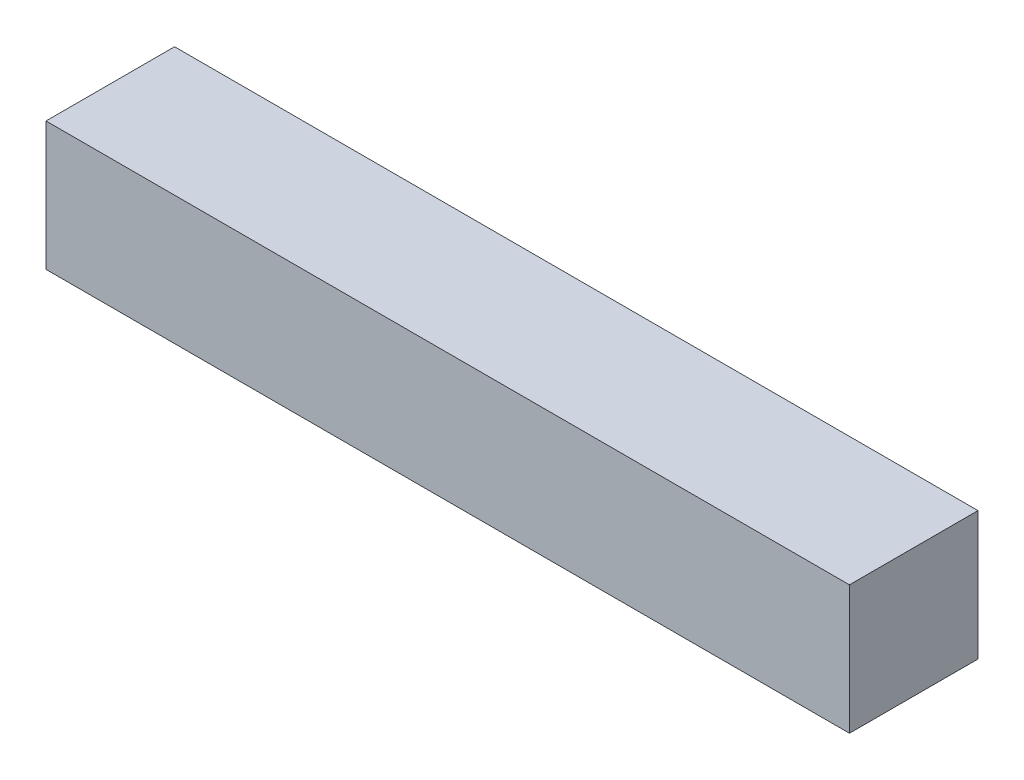
ISO-10303-21;
HEADER;
FILE_DESCRIPTION(('STEP AP214'),'2;1');
FILE_NAME('part.step','',(''),(''),'','','');
FILE_SCHEMA(('AUTOMOTIVE_DESIGN { 1 0 10303 214 1 1 1 1 }'));
ENDSEC;
DATA;
#1=APPLICATION_CONTEXT('core data for automotive mechanical design processes');
#2=APPLICATION_PROTOCOL_DEFINITION('international standard','automotive_design',2000,#1);
#3=PRODUCT_CONTEXT('',#1,'mechanical');
#4=PRODUCT('Part','Part','',(#3));
#5=PRODUCT_RELATED_PRODUCT_CATEGORY('part','',(#4));
#6=PRODUCT_DEFINITION_FORMATION('','',#4);
#7=PRODUCT_DEFINITION_CONTEXT('part definition',#1,'design');
#8=PRODUCT_DEFINITION('design','',#6,#7);
#9=PRODUCT_DEFINITION_SHAPE('','',#8);
#10=(LENGTH_UNIT() NAMED_UNIT(*) SI_UNIT(.MILLI.,.METRE.));
#11=(NAMED_UNIT(*) PLANE_ANGLE_UNIT() SI_UNIT($,.RADIAN.));
#12=(NAMED_UNIT(*) SI_UNIT($,.STERADIAN.) SOLID_ANGLE_UNIT());
#13=UNCERTAINTY_MEASURE_WITH_UNIT(LENGTH_MEASURE(1.E-05),#10,'distance_accuracy_value','');
#14=(GEOMETRIC_REPRESENTATION_CONTEXT(3) GLOBAL_UNCERTAINTY_ASSIGNED_CONTEXT((#13)) GLOBAL_UNIT_ASSIGNED_CONTEXT((#10,
#11,#12)) REPRESENTATION_CONTEXT('',''));
#15=CARTESIAN_POINT('',(0.,0.,0.));
#16=DIRECTION('',(0.,0.,1.));
#17=DIRECTION('',(1.,0.,0.));
#18=AXIS2_PLACEMENT_3D('',#15,#16,#17);
#19=CARTESIAN_POINT('',(0.,4.,0.));
#20=DIRECTION('',(1.,0.,0.));
#21=DIRECTION('',(0.,0.,-1.));
#22=AXIS2_PLACEMENT_3D('',#19,#20,#21);
#23=PLANE('',#22);
#24=DIRECTION('',(0.,0.,1.));
#25=VECTOR('',#24,1.);
#26=CARTESIAN_POINT('',(0.,0.,0.));
#27=LINE('',#26,#25);
#28=CARTESIAN_POINT('',(0.,0.,0.));
#29=VERTEX_POINT('',#28);
#30=CARTESIAN_POINT('',(0.,0.,4.));
#31=VERTEX_POINT('',#30);
#32=EDGE_CURVE('E101',#29,#31,#27,.T.);
#33=ORIENTED_EDGE('',*,*,#32,.T.);
#34=DIRECTION('',(0.,-1.,0.));
#35=VECTOR('',#34,1.);
#36=CARTESIAN_POINT('',(0.,4.,4.));
#37=LINE('',#36,#35);
#38=CARTESIAN_POINT('',(0.,4.,4.));
#39=VERTEX_POINT('',#38);
#40=EDGE_CURVE('E11',#39,#31,#37,.T.);
#41=ORIENTED_EDGE('',*,*,#40,.F.);
#42=DIRECTION('',(0.,0.,1.));
#43=VECTOR('',#42,1.);
#44=CARTESIAN_POINT('',(0.,4.,0.));
#45=LINE('',#44,#43);
#46=CARTESIAN_POINT('',(0.,4.,0.));
#47=VERTEX_POINT('',#46);
#48=EDGE_CURVE('E89',#47,#39,#45,.T.);
#49=ORIENTED_EDGE('',*,*,#48,.F.);
#50=DIRECTION('',(0.,-1.,0.));
#51=VECTOR('',#50,1.);
#52=CARTESIAN_POINT('',(0.,4.,0.));
#53=LINE('',#52,#51);
#54=EDGE_CURVE('E97',#47,#29,#53,.T.);
#55=ORIENTED_EDGE('',*,*,#54,.T.);
#56=EDGE_LOOP('',(#33,#41,#49,#55));
#57=FACE_BOUND('',#56,.T.);
#58=ADVANCED_FACE('F38',(#57),#23,.F.);
#59=CARTESIAN_POINT('',(0.,4.,4.));
#60=DIRECTION('',(0.,0.,-1.));
#61=DIRECTION('',(-1.,0.,0.));
#62=AXIS2_PLACEMENT_3D('',#59,#60,#61);
#63=PLANE('',#62);
#64=DIRECTION('',(1.,0.,0.));
#65=VECTOR('',#64,1.);
#66=CARTESIAN_POINT('',(0.,0.,4.));
#67=LINE('',#66,#65);
#68=CARTESIAN_POINT('',(25.,0.,4.));
#69=VERTEX_POINT('',#68);
#70=EDGE_CURVE('E93',#31,#69,#67,.T.);
#71=ORIENTED_EDGE('',*,*,#70,.T.);
#72=DIRECTION('',(0.,-1.,0.));
#73=VECTOR('',#72,1.);
#74=CARTESIAN_POINT('',(25.,4.,4.));
#75=LINE('',#74,#73);
#76=CARTESIAN_POINT('',(25.,4.,4.));
#77=VERTEX_POINT('',#76);
#78=EDGE_CURVE('E46',#77,#69,#75,.T.);
#79=ORIENTED_EDGE('',*,*,#78,.F.);
#80=DIRECTION('',(1.,0.,0.));
#81=VECTOR('',#80,1.);
#82=CARTESIAN_POINT('',(0.,4.,4.));
#83=LINE('',#82,#81);
#84=EDGE_CURVE('E84',#39,#77,#83,.T.);
#85=ORIENTED_EDGE('',*,*,#84,.F.);
#86=ORIENTED_EDGE('',*,*,#40,.T.);
#87=EDGE_LOOP('',(#71,#79,#85,#86));
#88=FACE_BOUND('',#87,.T.);
#89=ADVANCED_FACE('F92',(#88),#63,.F.);
#90=CARTESIAN_POINT('',(25.,4.,0.));
#91=DIRECTION('',(-1.,0.,0.));
#92=DIRECTION('',(0.,0.,1.));
#93=AXIS2_PLACEMENT_3D('',#90,#91,#92);
#94=PLANE('',#93);
#95=DIRECTION('',(0.,0.,-1.));
#96=VECTOR('',#95,1.);
#97=CARTESIAN_POINT('',(25.,0.,0.));
#98=LINE('',#97,#96);
#99=CARTESIAN_POINT('',(25.,0.,0.));
#100=VERTEX_POINT('',#99);
#101=EDGE_CURVE('E71',#69,#100,#98,.T.);
#102=ORIENTED_EDGE('',*,*,#101,.T.);
#103=DIRECTION('',(0.,-1.,0.));
#104=VECTOR('',#103,1.);
#105=CARTESIAN_POINT('',(25.,4.,0.));
#106=LINE('',#105,#104);
#107=CARTESIAN_POINT('',(25.,4.,0.));
#108=VERTEX_POINT('',#107);
#109=EDGE_CURVE('E94',#108,#100,#106,.T.);
#110=ORIENTED_EDGE('',*,*,#109,.F.);
#111=DIRECTION('',(0.,0.,-1.));
#112=VECTOR('',#111,1.);
#113=CARTESIAN_POINT('',(25.,4.,0.));
#114=LINE('',#113,#112);
#115=EDGE_CURVE('E87',#77,#108,#114,.T.);
#116=ORIENTED_EDGE('',*,*,#115,.F.);
#117=ORIENTED_EDGE('',*,*,#78,.T.);
#118=EDGE_LOOP('',(#102,#110,#116,#117));
#119=FACE_BOUND('',#118,.T.);
#120=ADVANCED_FACE('F95',(#119),#94,.F.);
#121=CARTESIAN_POINT('',(0.,4.,0.));
#122=DIRECTION('',(0.,0.,1.));
#123=DIRECTION('',(1.,0.,0.));
#124=AXIS2_PLACEMENT_3D('',#121,#122,#123);
#125=PLANE('',#124);
#126=DIRECTION('',(-1.,0.,0.));
#127=VECTOR('',#126,1.);
#128=CARTESIAN_POINT('',(0.,0.,0.));
#129=LINE('',#128,#127);
#130=EDGE_CURVE('E77',#100,#29,#129,.T.);
#131=ORIENTED_EDGE('',*,*,#130,.T.);
#132=ORIENTED_EDGE('',*,*,#54,.F.);
#133=DIRECTION('',(-1.,0.,0.));
#134=VECTOR('',#133,1.);
#135=CARTESIAN_POINT('',(0.,4.,0.));
#136=LINE('',#135,#134);
#137=EDGE_CURVE('E54',#108,#47,#136,.T.);
#138=ORIENTED_EDGE('',*,*,#137,.F.);
#139=ORIENTED_EDGE('',*,*,#109,.T.);
#140=EDGE_LOOP('',(#131,#132,#138,#139));
#141=FACE_BOUND('',#140,.T.);
#142=ADVANCED_FACE('F108',(#141),#125,.F.);
#143=CARTESIAN_POINT('',(0.,4.,0.));
#144=DIRECTION('',(0.,1.,0.));
#145=DIRECTION('',(0.,0.,1.));
#146=AXIS2_PLACEMENT_3D('',#143,#144,#145);
#147=PLANE('',#146);
#148=ORIENTED_EDGE('',*,*,#48,.T.);
#149=ORIENTED_EDGE('',*,*,#84,.T.);
#150=ORIENTED_EDGE('',*,*,#115,.T.);
#151=ORIENTED_EDGE('',*,*,#137,.T.);
#152=EDGE_LOOP('',(#148,#149,#150,#151));
#153=FACE_BOUND('',#152,.T.);
#154=ADVANCED_FACE('F85',(#153),#147,.T.);
#155=CARTESIAN_POINT('',(0.,0.,0.));
#156=DIRECTION('',(0.,1.,0.));
#157=DIRECTION('',(0.,0.,1.));
#158=AXIS2_PLACEMENT_3D('',#155,#156,#157);
#159=PLANE('',#158);
#160=ORIENTED_EDGE('',*,*,#32,.F.);
#161=ORIENTED_EDGE('',*,*,#130,.F.);
#162=ORIENTED_EDGE('',*,*,#101,.F.);
#163=ORIENTED_EDGE('',*,*,#70,.F.);
#164=EDGE_LOOP('',(#160,#161,#162,#163));
#165=FACE_BOUND('',#164,.T.);
#166=ADVANCED_FACE('F111',(#165),#159,.F.);
#167=CLOSED_SHELL('',(#58,#89,#120,#142,#154,#166));
#168=MANIFOLD_SOLID_BREP('B2',#167);
#169=ADVANCED_BREP_SHAPE_REPRESENTATION('',(#18,#168),#14);
#170=SHAPE_DEFINITION_REPRESENTATION(#9,#169);
ENDSEC;
END-ISO-10303-21;
